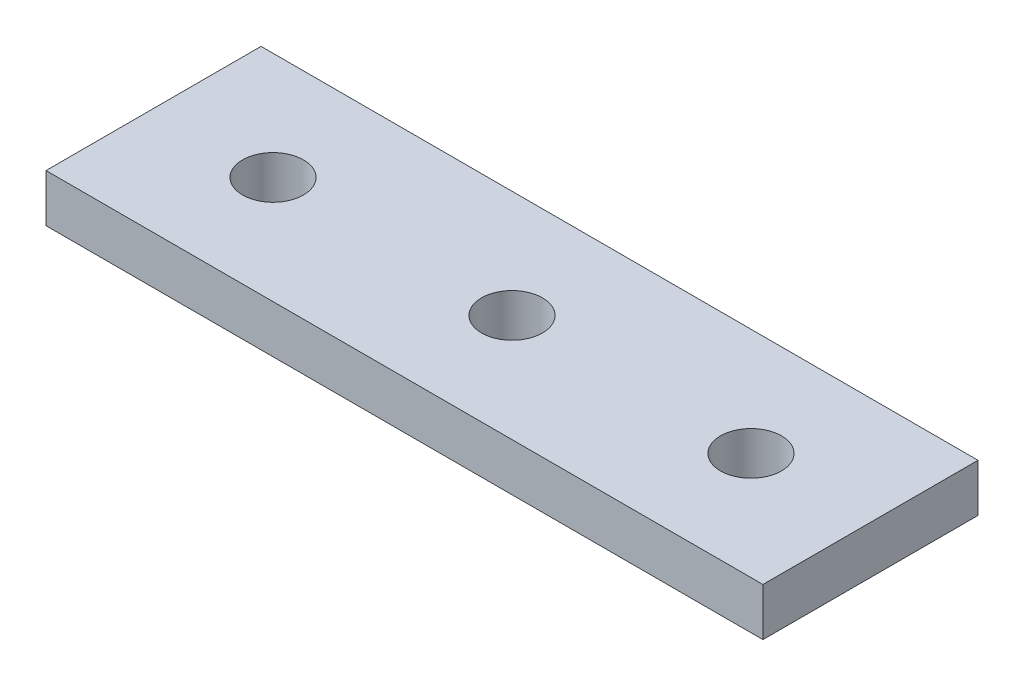
ISO-10303-21;
HEADER;
FILE_DESCRIPTION(('STEP AP214'),'2;1');
FILE_NAME('part.step','',(''),(''),'','','');
FILE_SCHEMA(('AUTOMOTIVE_DESIGN { 1 0 10303 214 1 1 1 1 }'));
ENDSEC;
DATA;
#1=APPLICATION_CONTEXT('core data for automotive mechanical design processes');
#2=APPLICATION_PROTOCOL_DEFINITION('international standard','automotive_design',2000,#1);
#3=PRODUCT_CONTEXT('',#1,'mechanical');
#4=PRODUCT('Part','Part','',(#3));
#5=PRODUCT_RELATED_PRODUCT_CATEGORY('part','',(#4));
#6=PRODUCT_DEFINITION_FORMATION('','',#4);
#7=PRODUCT_DEFINITION_CONTEXT('part definition',#1,'design');
#8=PRODUCT_DEFINITION('design','',#6,#7);
#9=PRODUCT_DEFINITION_SHAPE('','',#8);
#10=(LENGTH_UNIT() NAMED_UNIT(*) SI_UNIT(.MILLI.,.METRE.));
#11=(NAMED_UNIT(*) PLANE_ANGLE_UNIT() SI_UNIT($,.RADIAN.));
#12=(NAMED_UNIT(*) SI_UNIT($,.STERADIAN.) SOLID_ANGLE_UNIT());
#13=UNCERTAINTY_MEASURE_WITH_UNIT(LENGTH_MEASURE(1.E-05),#10,'distance_accuracy_value','');
#14=(GEOMETRIC_REPRESENTATION_CONTEXT(3) GLOBAL_UNCERTAINTY_ASSIGNED_CONTEXT((#13)) GLOBAL_UNIT_ASSIGNED_CONTEXT((#10,
#11,#12)) REPRESENTATION_CONTEXT('',''));
#15=CARTESIAN_POINT('',(0.,0.,0.));
#16=DIRECTION('',(0.,0.,1.));
#17=DIRECTION('',(1.,0.,0.));
#18=AXIS2_PLACEMENT_3D('',#15,#16,#17);
#19=CARTESIAN_POINT('',(0.,4.,0.));
#20=DIRECTION('',(0.,1.,0.));
#21=DIRECTION('',(0.,0.,1.));
#22=AXIS2_PLACEMENT_3D('',#19,#20,#21);
#23=PLANE('',#22);
#24=CARTESIAN_POINT('',(20.,4.,0.));
#25=DIRECTION('',(0.,1.,0.));
#26=DIRECTION('',(0.,0.,-1.));
#27=AXIS2_PLACEMENT_3D('',#24,#25,#26);
#28=CIRCLE('',#27,2.55);
#29=CARTESIAN_POINT('',(20.,4.,-2.55));
#30=VERTEX_POINT('',#29);
#31=EDGE_CURVE('E117',#30,#30,#28,.T.);
#32=ORIENTED_EDGE('',*,*,#31,.F.);
#33=EDGE_LOOP('',(#32));
#34=FACE_BOUND('',#33,.T.);
#35=DIRECTION('',(0.,0.,1.));
#36=VECTOR('',#35,1.);
#37=CARTESIAN_POINT('',(-30.,4.,9.00000000000001));
#38=LINE('',#37,#36);
#39=CARTESIAN_POINT('',(-30.,4.,-8.99999999999999));
#40=VERTEX_POINT('',#39);
#41=CARTESIAN_POINT('',(-30.,4.,9.00000000000001));
#42=VERTEX_POINT('',#41);
#43=EDGE_CURVE('E87',#40,#42,#38,.T.);
#44=ORIENTED_EDGE('',*,*,#43,.T.);
#45=DIRECTION('',(1.,0.,0.));
#46=VECTOR('',#45,1.);
#47=CARTESIAN_POINT('',(30.,4.,9.00000000000001));
#48=LINE('',#47,#46);
#49=CARTESIAN_POINT('',(30.,4.,9.00000000000001));
#50=VERTEX_POINT('',#49);
#51=EDGE_CURVE('E82',#42,#50,#48,.T.);
#52=ORIENTED_EDGE('',*,*,#51,.T.);
#53=DIRECTION('',(0.,0.,-1.));
#54=VECTOR('',#53,1.);
#55=CARTESIAN_POINT('',(30.,4.,9.00000000000001));
#56=LINE('',#55,#54);
#57=CARTESIAN_POINT('',(30.,4.,-8.99999999999999));
#58=VERTEX_POINT('',#57);
#59=EDGE_CURVE('E85',#50,#58,#56,.T.);
#60=ORIENTED_EDGE('',*,*,#59,.T.);
#61=DIRECTION('',(-1.,0.,0.));
#62=VECTOR('',#61,1.);
#63=CARTESIAN_POINT('',(30.,4.,-8.99999999999999));
#64=LINE('',#63,#62);
#65=EDGE_CURVE('E52',#58,#40,#64,.T.);
#66=ORIENTED_EDGE('',*,*,#65,.T.);
#67=EDGE_LOOP('',(#44,#52,#60,#66));
#68=FACE_BOUND('',#67,.T.);
#69=CARTESIAN_POINT('',(-20.,4.,0.));
#70=DIRECTION('',(0.,1.,0.));
#71=DIRECTION('',(0.,0.,1.));
#72=AXIS2_PLACEMENT_3D('',#69,#70,#71);
#73=CIRCLE('',#72,2.55);
#74=CARTESIAN_POINT('',(-20.,4.,2.55));
#75=VERTEX_POINT('',#74);
#76=EDGE_CURVE('E102',#75,#75,#73,.T.);
#77=ORIENTED_EDGE('',*,*,#76,.F.);
#78=EDGE_LOOP('',(#77));
#79=FACE_BOUND('',#78,.T.);
#80=CARTESIAN_POINT('',(0.,4.,0.));
#81=DIRECTION('',(0.,1.,0.));
#82=DIRECTION('',(0.,0.,1.));
#83=AXIS2_PLACEMENT_3D('',#80,#81,#82);
#84=CIRCLE('',#83,2.55);
#85=CARTESIAN_POINT('',(0.,4.,2.55));
#86=VERTEX_POINT('',#85);
#87=EDGE_CURVE('E123',#86,#86,#84,.T.);
#88=ORIENTED_EDGE('',*,*,#87,.F.);
#89=EDGE_LOOP('',(#88));
#90=FACE_BOUND('',#89,.T.);
#91=ADVANCED_FACE('F35',(#34,#68,#79,#90),#23,.T.);
#92=CARTESIAN_POINT('',(0.,0.,0.));
#93=DIRECTION('',(0.,1.,0.));
#94=DIRECTION('',(0.,0.,1.));
#95=AXIS2_PLACEMENT_3D('',#92,#93,#94);
#96=PLANE('',#95);
#97=CARTESIAN_POINT('',(20.,0.,0.));
#98=DIRECTION('',(0.,1.,0.));
#99=DIRECTION('',(0.,0.,-1.));
#100=AXIS2_PLACEMENT_3D('',#97,#98,#99);
#101=CIRCLE('',#100,2.55);
#102=CARTESIAN_POINT('',(20.,0.,-2.55));
#103=VERTEX_POINT('',#102);
#104=EDGE_CURVE('E120',#103,#103,#101,.T.);
#105=ORIENTED_EDGE('',*,*,#104,.T.);
#106=EDGE_LOOP('',(#105));
#107=FACE_BOUND('',#106,.T.);
#108=DIRECTION('',(0.,0.,1.));
#109=VECTOR('',#108,1.);
#110=CARTESIAN_POINT('',(-30.,0.,9.00000000000001));
#111=LINE('',#110,#109);
#112=CARTESIAN_POINT('',(-30.,0.,-8.99999999999999));
#113=VERTEX_POINT('',#112);
#114=CARTESIAN_POINT('',(-30.,0.,9.00000000000001));
#115=VERTEX_POINT('',#114);
#116=EDGE_CURVE('E99',#113,#115,#111,.T.);
#117=ORIENTED_EDGE('',*,*,#116,.F.);
#118=DIRECTION('',(-1.,0.,0.));
#119=VECTOR('',#118,1.);
#120=CARTESIAN_POINT('',(30.,0.,-8.99999999999999));
#121=LINE('',#120,#119);
#122=CARTESIAN_POINT('',(30.,0.,-8.99999999999999));
#123=VERTEX_POINT('',#122);
#124=EDGE_CURVE('E75',#123,#113,#121,.T.);
#125=ORIENTED_EDGE('',*,*,#124,.F.);
#126=DIRECTION('',(0.,0.,-1.));
#127=VECTOR('',#126,1.);
#128=CARTESIAN_POINT('',(30.,0.,9.00000000000001));
#129=LINE('',#128,#127);
#130=CARTESIAN_POINT('',(30.,0.,9.00000000000001));
#131=VERTEX_POINT('',#130);
#132=EDGE_CURVE('E69',#131,#123,#129,.T.);
#133=ORIENTED_EDGE('',*,*,#132,.F.);
#134=DIRECTION('',(1.,0.,0.));
#135=VECTOR('',#134,1.);
#136=CARTESIAN_POINT('',(30.,0.,9.00000000000001));
#137=LINE('',#136,#135);
#138=EDGE_CURVE('E91',#115,#131,#137,.T.);
#139=ORIENTED_EDGE('',*,*,#138,.F.);
#140=EDGE_LOOP('',(#117,#125,#133,#139));
#141=FACE_BOUND('',#140,.T.);
#142=CARTESIAN_POINT('',(-20.,0.,0.));
#143=DIRECTION('',(0.,1.,0.));
#144=DIRECTION('',(0.,0.,1.));
#145=AXIS2_PLACEMENT_3D('',#142,#143,#144);
#146=CIRCLE('',#145,2.55);
#147=CARTESIAN_POINT('',(-20.,0.,2.55));
#148=VERTEX_POINT('',#147);
#149=EDGE_CURVE('E114',#148,#148,#146,.T.);
#150=ORIENTED_EDGE('',*,*,#149,.T.);
#151=EDGE_LOOP('',(#150));
#152=FACE_BOUND('',#151,.T.);
#153=CARTESIAN_POINT('',(0.,0.,0.));
#154=DIRECTION('',(0.,1.,0.));
#155=DIRECTION('',(0.,0.,1.));
#156=AXIS2_PLACEMENT_3D('',#153,#154,#155);
#157=CIRCLE('',#156,2.55);
#158=CARTESIAN_POINT('',(0.,0.,2.55));
#159=VERTEX_POINT('',#158);
#160=EDGE_CURVE('E126',#159,#159,#157,.T.);
#161=ORIENTED_EDGE('',*,*,#160,.T.);
#162=EDGE_LOOP('',(#161));
#163=FACE_BOUND('',#162,.T.);
#164=ADVANCED_FACE('F110',(#107,#141,#152,#163),#96,.F.);
#165=CARTESIAN_POINT('',(-30.,4.,9.00000000000001));
#166=DIRECTION('',(1.,0.,0.));
#167=DIRECTION('',(0.,0.,-1.));
#168=AXIS2_PLACEMENT_3D('',#165,#166,#167);
#169=PLANE('',#168);
#170=ORIENTED_EDGE('',*,*,#116,.T.);
#171=DIRECTION('',(0.,-1.,0.));
#172=VECTOR('',#171,1.);
#173=CARTESIAN_POINT('',(-30.,4.,9.00000000000001));
#174=LINE('',#173,#172);
#175=EDGE_CURVE('E11',#42,#115,#174,.T.);
#176=ORIENTED_EDGE('',*,*,#175,.F.);
#177=ORIENTED_EDGE('',*,*,#43,.F.);
#178=DIRECTION('',(0.,-1.,0.));
#179=VECTOR('',#178,1.);
#180=CARTESIAN_POINT('',(-30.,4.,-8.99999999999999));
#181=LINE('',#180,#179);
#182=EDGE_CURVE('E95',#40,#113,#181,.T.);
#183=ORIENTED_EDGE('',*,*,#182,.T.);
#184=EDGE_LOOP('',(#170,#176,#177,#183));
#185=FACE_BOUND('',#184,.T.);
#186=ADVANCED_FACE('F37',(#185),#169,.F.);
#187=CARTESIAN_POINT('',(30.,4.,9.00000000000001));
#188=DIRECTION('',(0.,0.,-1.));
#189=DIRECTION('',(-1.,0.,0.));
#190=AXIS2_PLACEMENT_3D('',#187,#188,#189);
#191=PLANE('',#190);
#192=ORIENTED_EDGE('',*,*,#138,.T.);
#193=DIRECTION('',(0.,-1.,0.));
#194=VECTOR('',#193,1.);
#195=CARTESIAN_POINT('',(30.,4.,9.00000000000001));
#196=LINE('',#195,#194);
#197=EDGE_CURVE('E44',#50,#131,#196,.T.);
#198=ORIENTED_EDGE('',*,*,#197,.F.);
#199=ORIENTED_EDGE('',*,*,#51,.F.);
#200=ORIENTED_EDGE('',*,*,#175,.T.);
#201=EDGE_LOOP('',(#192,#198,#199,#200));
#202=FACE_BOUND('',#201,.T.);
#203=ADVANCED_FACE('F90',(#202),#191,.F.);
#204=CARTESIAN_POINT('',(30.,4.,9.00000000000001));
#205=DIRECTION('',(-1.,0.,0.));
#206=DIRECTION('',(0.,0.,1.));
#207=AXIS2_PLACEMENT_3D('',#204,#205,#206);
#208=PLANE('',#207);
#209=ORIENTED_EDGE('',*,*,#132,.T.);
#210=DIRECTION('',(0.,-1.,0.));
#211=VECTOR('',#210,1.);
#212=CARTESIAN_POINT('',(30.,4.,-8.99999999999999));
#213=LINE('',#212,#211);
#214=EDGE_CURVE('E92',#58,#123,#213,.T.);
#215=ORIENTED_EDGE('',*,*,#214,.F.);
#216=ORIENTED_EDGE('',*,*,#59,.F.);
#217=ORIENTED_EDGE('',*,*,#197,.T.);
#218=EDGE_LOOP('',(#209,#215,#216,#217));
#219=FACE_BOUND('',#218,.T.);
#220=ADVANCED_FACE('F93',(#219),#208,.F.);
#221=CARTESIAN_POINT('',(30.,4.,-8.99999999999999));
#222=DIRECTION('',(0.,0.,1.));
#223=DIRECTION('',(1.,0.,0.));
#224=AXIS2_PLACEMENT_3D('',#221,#222,#223);
#225=PLANE('',#224);
#226=ORIENTED_EDGE('',*,*,#124,.T.);
#227=ORIENTED_EDGE('',*,*,#182,.F.);
#228=ORIENTED_EDGE('',*,*,#65,.F.);
#229=ORIENTED_EDGE('',*,*,#214,.T.);
#230=EDGE_LOOP('',(#226,#227,#228,#229));
#231=FACE_BOUND('',#230,.T.);
#232=ADVANCED_FACE('F107',(#231),#225,.F.);
#233=CARTESIAN_POINT('',(-20.,4.,0.));
#234=DIRECTION('',(0.,-1.,0.));
#235=DIRECTION('',(0.,0.,-1.));
#236=AXIS2_PLACEMENT_3D('',#233,#234,#235);
#237=CYLINDRICAL_SURFACE('',#236,2.55);
#238=ORIENTED_EDGE('',*,*,#76,.T.);
#239=EDGE_LOOP('',(#238));
#240=FACE_BOUND('',#239,.T.);
#241=ORIENTED_EDGE('',*,*,#149,.F.);
#242=EDGE_LOOP('',(#241));
#243=FACE_BOUND('',#242,.T.);
#244=ADVANCED_FACE('F145',(#240,#243),#237,.F.);
#245=CARTESIAN_POINT('',(20.,4.,0.));
#246=DIRECTION('',(0.,-1.,0.));
#247=DIRECTION('',(0.,0.,-1.));
#248=AXIS2_PLACEMENT_3D('',#245,#246,#247);
#249=CYLINDRICAL_SURFACE('',#248,2.55);
#250=ORIENTED_EDGE('',*,*,#31,.T.);
#251=EDGE_LOOP('',(#250));
#252=FACE_BOUND('',#251,.T.);
#253=ORIENTED_EDGE('',*,*,#104,.F.);
#254=EDGE_LOOP('',(#253));
#255=FACE_BOUND('',#254,.T.);
#256=ADVANCED_FACE('F191',(#252,#255),#249,.F.);
#257=CARTESIAN_POINT('',(0.,4.,0.));
#258=DIRECTION('',(0.,-1.,0.));
#259=DIRECTION('',(0.,0.,-1.));
#260=AXIS2_PLACEMENT_3D('',#257,#258,#259);
#261=CYLINDRICAL_SURFACE('',#260,2.55);
#262=ORIENTED_EDGE('',*,*,#87,.T.);
#263=EDGE_LOOP('',(#262));
#264=FACE_BOUND('',#263,.T.);
#265=ORIENTED_EDGE('',*,*,#160,.F.);
#266=EDGE_LOOP('',(#265));
#267=FACE_BOUND('',#266,.T.);
#268=ADVANCED_FACE('F132',(#264,#267),#261,.F.);
#269=CLOSED_SHELL('',(#91,#164,#186,#203,#220,#232,#244,#256,#268));
#270=MANIFOLD_SOLID_BREP('B2',#269);
#271=ADVANCED_BREP_SHAPE_REPRESENTATION('',(#18,#270),#14);
#272=SHAPE_DEFINITION_REPRESENTATION(#9,#271);
ENDSEC;
END-ISO-10303-21;
